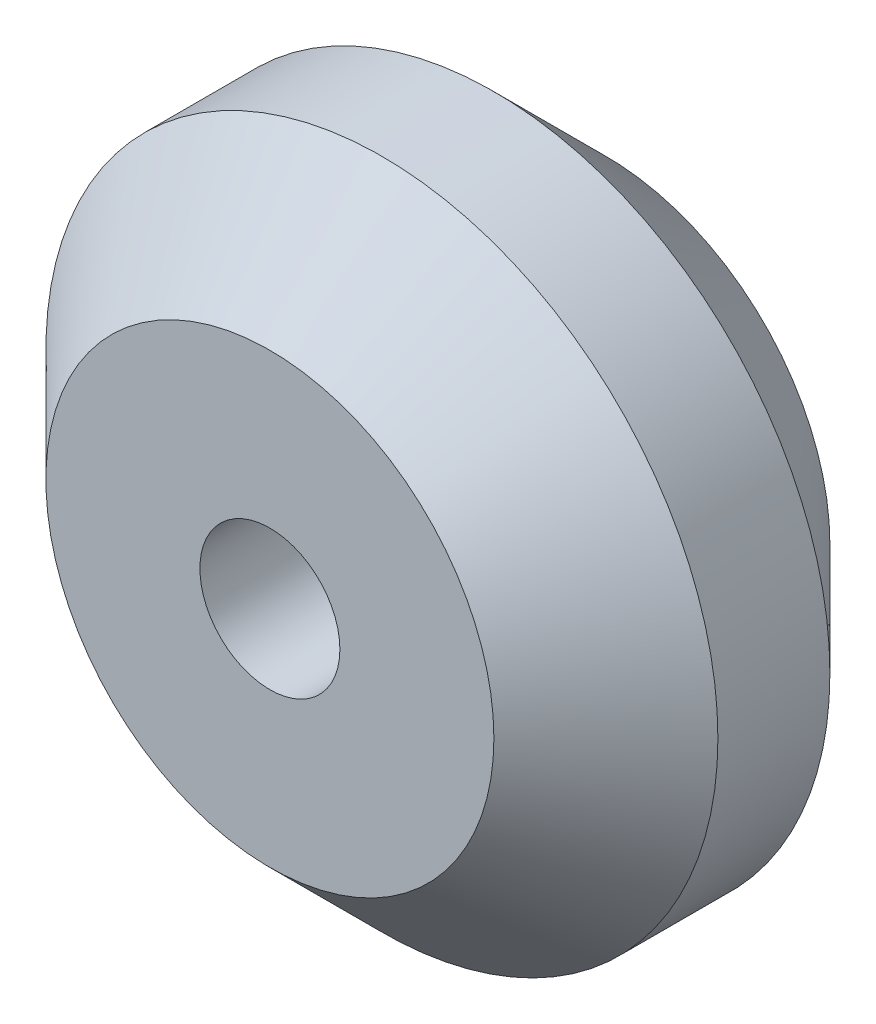
ISO-10303-21;
HEADER;
FILE_DESCRIPTION(('STEP AP214'),'2;1');
FILE_NAME('part.step','',(''),(''),'','','');
FILE_SCHEMA(('AUTOMOTIVE_DESIGN { 1 0 10303 214 1 1 1 1 }'));
ENDSEC;
DATA;
#1=APPLICATION_CONTEXT('core data for automotive mechanical design processes');
#2=APPLICATION_PROTOCOL_DEFINITION('international standard','automotive_design',2000,#1);
#3=PRODUCT_CONTEXT('',#1,'mechanical');
#4=PRODUCT('Part','Part','',(#3));
#5=PRODUCT_RELATED_PRODUCT_CATEGORY('part','',(#4));
#6=PRODUCT_DEFINITION_FORMATION('','',#4);
#7=PRODUCT_DEFINITION_CONTEXT('part definition',#1,'design');
#8=PRODUCT_DEFINITION('design','',#6,#7);
#9=PRODUCT_DEFINITION_SHAPE('','',#8);
#10=(LENGTH_UNIT() NAMED_UNIT(*) SI_UNIT(.MILLI.,.METRE.));
#11=(NAMED_UNIT(*) PLANE_ANGLE_UNIT() SI_UNIT($,.RADIAN.));
#12=(NAMED_UNIT(*) SI_UNIT($,.STERADIAN.) SOLID_ANGLE_UNIT());
#13=UNCERTAINTY_MEASURE_WITH_UNIT(LENGTH_MEASURE(1.E-05),#10,'distance_accuracy_value','');
#14=(GEOMETRIC_REPRESENTATION_CONTEXT(3) GLOBAL_UNCERTAINTY_ASSIGNED_CONTEXT((#13)) GLOBAL_UNIT_ASSIGNED_CONTEXT((#10,
#11,#12)) REPRESENTATION_CONTEXT('',''));
#15=CARTESIAN_POINT('',(0.,0.,0.));
#16=DIRECTION('',(0.,0.,1.));
#17=DIRECTION('',(1.,0.,0.));
#18=AXIS2_PLACEMENT_3D('',#15,#16,#17);
#19=CARTESIAN_POINT('',(0.,0.,12.));
#20=DIRECTION('',(0.,0.,1.));
#21=DIRECTION('',(1.,0.,0.));
#22=AXIS2_PLACEMENT_3D('',#19,#20,#21);
#23=PLANE('',#22);
#24=CARTESIAN_POINT('',(0.,0.,12.));
#25=DIRECTION('',(0.,0.,1.));
#26=DIRECTION('',(1.,0.,0.));
#27=AXIS2_PLACEMENT_3D('',#24,#25,#26);
#28=CIRCLE('',#27,8.00000000000001);
#29=CARTESIAN_POINT('',(8.00000000000001,0.,12.));
#30=VERTEX_POINT('',#29);
#31=EDGE_CURVE('E10',#30,#30,#28,.T.);
#32=ORIENTED_EDGE('',*,*,#31,.T.);
#33=EDGE_LOOP('',(#32));
#34=FACE_BOUND('',#33,.T.);
#35=CARTESIAN_POINT('',(0.,0.,12.));
#36=DIRECTION('',(0.,0.,1.));
#37=DIRECTION('',(1.,0.,0.));
#38=AXIS2_PLACEMENT_3D('',#35,#36,#37);
#39=CIRCLE('',#38,2.5);
#40=CARTESIAN_POINT('',(2.5,0.,12.));
#41=VERTEX_POINT('',#40);
#42=EDGE_CURVE('E54',#41,#41,#39,.T.);
#43=ORIENTED_EDGE('',*,*,#42,.F.);
#44=EDGE_LOOP('',(#43));
#45=FACE_BOUND('',#44,.T.);
#46=ADVANCED_FACE('F33',(#34,#45),#23,.T.);
#47=CARTESIAN_POINT('',(0.,0.,0.));
#48=DIRECTION('',(0.,0.,1.));
#49=DIRECTION('',(1.,0.,0.));
#50=AXIS2_PLACEMENT_3D('',#47,#48,#49);
#51=PLANE('',#50);
#52=CARTESIAN_POINT('',(0.,0.,0.));
#53=DIRECTION('',(0.,0.,1.));
#54=DIRECTION('',(1.,0.,0.));
#55=AXIS2_PLACEMENT_3D('',#52,#53,#54);
#56=CIRCLE('',#55,7.99999999999999);
#57=CARTESIAN_POINT('',(7.99999999999999,0.,0.));
#58=VERTEX_POINT('',#57);
#59=EDGE_CURVE('E41',#58,#58,#56,.F.);
#60=ORIENTED_EDGE('',*,*,#59,.T.);
#61=EDGE_LOOP('',(#60));
#62=FACE_BOUND('',#61,.T.);
#63=CARTESIAN_POINT('',(0.,0.,0.));
#64=DIRECTION('',(0.,0.,1.));
#65=DIRECTION('',(1.,0.,0.));
#66=AXIS2_PLACEMENT_3D('',#63,#64,#65);
#67=CIRCLE('',#66,2.5);
#68=CARTESIAN_POINT('',(2.5,0.,0.));
#69=VERTEX_POINT('',#68);
#70=EDGE_CURVE('E55',#69,#69,#67,.T.);
#71=ORIENTED_EDGE('',*,*,#70,.T.);
#72=EDGE_LOOP('',(#71));
#73=FACE_BOUND('',#72,.T.);
#74=ADVANCED_FACE('F65',(#62,#73),#51,.F.);
#75=CARTESIAN_POINT('',(0.,0.,12.));
#76=DIRECTION('',(0.,0.,-1.));
#77=DIRECTION('',(-1.,0.,0.));
#78=AXIS2_PLACEMENT_3D('',#75,#76,#77);
#79=CYLINDRICAL_SURFACE('',#78,12.);
#80=CARTESIAN_POINT('',(0.,0.,4.));
#81=DIRECTION('',(0.,0.,1.));
#82=DIRECTION('',(1.,0.,0.));
#83=AXIS2_PLACEMENT_3D('',#80,#81,#82);
#84=CIRCLE('',#83,12.);
#85=CARTESIAN_POINT('',(12.,0.,4.));
#86=VERTEX_POINT('',#85);
#87=EDGE_CURVE('E45',#86,#86,#84,.T.);
#88=ORIENTED_EDGE('',*,*,#87,.T.);
#89=EDGE_LOOP('',(#88));
#90=FACE_BOUND('',#89,.T.);
#91=CARTESIAN_POINT('',(0.,0.,8.));
#92=DIRECTION('',(0.,0.,1.));
#93=DIRECTION('',(1.,0.,0.));
#94=AXIS2_PLACEMENT_3D('',#91,#92,#93);
#95=CIRCLE('',#94,12.);
#96=CARTESIAN_POINT('',(12.,0.,8.));
#97=VERTEX_POINT('',#96);
#98=EDGE_CURVE('E49',#97,#97,#95,.F.);
#99=ORIENTED_EDGE('',*,*,#98,.T.);
#100=EDGE_LOOP('',(#99));
#101=FACE_BOUND('',#100,.T.);
#102=ADVANCED_FACE('F70',(#90,#101),#79,.T.);
#103=CARTESIAN_POINT('',(0.,0.,12.));
#104=DIRECTION('',(0.,0.,-1.));
#105=DIRECTION('',(-1.,0.,0.));
#106=AXIS2_PLACEMENT_3D('',#103,#104,#105);
#107=CYLINDRICAL_SURFACE('',#106,2.5);
#108=ORIENTED_EDGE('',*,*,#42,.T.);
#109=EDGE_LOOP('',(#108));
#110=FACE_BOUND('',#109,.T.);
#111=ORIENTED_EDGE('',*,*,#70,.F.);
#112=EDGE_LOOP('',(#111));
#113=FACE_BOUND('',#112,.T.);
#114=ADVANCED_FACE('F61',(#110,#113),#107,.F.);
#115=CARTESIAN_POINT('',(0.,0.,4.));
#116=DIRECTION('',(0.,0.,1.));
#117=DIRECTION('',(1.,0.,0.));
#118=AXIS2_PLACEMENT_3D('',#115,#116,#117);
#119=CONICAL_SURFACE('',#118,12.,0.78539816339745);
#120=ORIENTED_EDGE('',*,*,#59,.F.);
#121=EDGE_LOOP('',(#120));
#122=FACE_BOUND('',#121,.T.);
#123=ORIENTED_EDGE('',*,*,#87,.F.);
#124=EDGE_LOOP('',(#123));
#125=FACE_BOUND('',#124,.T.);
#126=ADVANCED_FACE('F77',(#122,#125),#119,.T.);
#127=CARTESIAN_POINT('',(0.,0.,12.));
#128=DIRECTION('',(0.,0.,-1.));
#129=DIRECTION('',(-1.,0.,0.));
#130=AXIS2_PLACEMENT_3D('',#127,#128,#129);
#131=CONICAL_SURFACE('',#130,8.00000000000001,0.785398163397447);
#132=ORIENTED_EDGE('',*,*,#98,.F.);
#133=EDGE_LOOP('',(#132));
#134=FACE_BOUND('',#133,.T.);
#135=ORIENTED_EDGE('',*,*,#31,.F.);
#136=EDGE_LOOP('',(#135));
#137=FACE_BOUND('',#136,.T.);
#138=ADVANCED_FACE('F36',(#134,#137),#131,.T.);
#139=CLOSED_SHELL('',(#46,#74,#102,#114,#126,#138));
#140=MANIFOLD_SOLID_BREP('B2',#139);
#141=ADVANCED_BREP_SHAPE_REPRESENTATION('',(#18,#140),#14);
#142=SHAPE_DEFINITION_REPRESENTATION(#9,#141);
ENDSEC;
END-ISO-10303-21;
